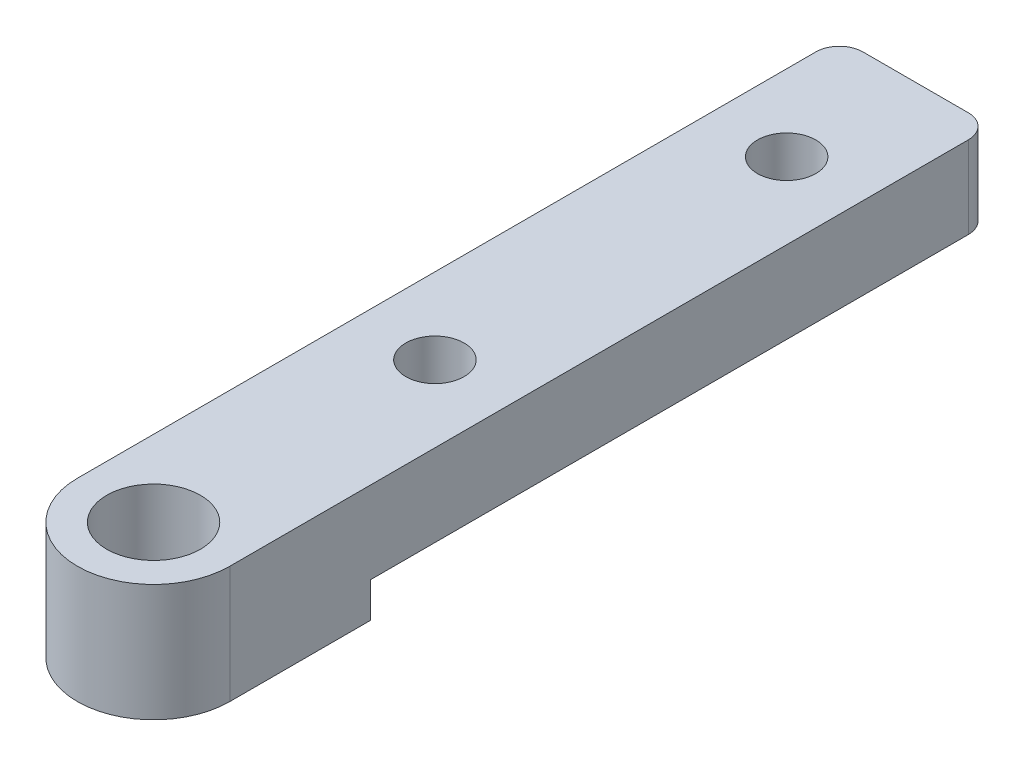
ISO-10303-21;
HEADER;
FILE_DESCRIPTION(('STEP AP214'),'2;1');
FILE_NAME('part.step','',(''),(''),'','','');
FILE_SCHEMA(('AUTOMOTIVE_DESIGN { 1 0 10303 214 1 1 1 1 }'));
ENDSEC;
DATA;
#1=APPLICATION_CONTEXT('core data for automotive mechanical design processes');
#2=APPLICATION_PROTOCOL_DEFINITION('international standard','automotive_design',2000,#1);
#3=PRODUCT_CONTEXT('',#1,'mechanical');
#4=PRODUCT('Part','Part','',(#3));
#5=PRODUCT_RELATED_PRODUCT_CATEGORY('part','',(#4));
#6=PRODUCT_DEFINITION_FORMATION('','',#4);
#7=PRODUCT_DEFINITION_CONTEXT('part definition',#1,'design');
#8=PRODUCT_DEFINITION('design','',#6,#7);
#9=PRODUCT_DEFINITION_SHAPE('','',#8);
#10=(LENGTH_UNIT() NAMED_UNIT(*) SI_UNIT(.MILLI.,.METRE.));
#11=(NAMED_UNIT(*) PLANE_ANGLE_UNIT() SI_UNIT($,.RADIAN.));
#12=(NAMED_UNIT(*) SI_UNIT($,.STERADIAN.) SOLID_ANGLE_UNIT());
#13=UNCERTAINTY_MEASURE_WITH_UNIT(LENGTH_MEASURE(1.E-05),#10,'distance_accuracy_value','');
#14=(GEOMETRIC_REPRESENTATION_CONTEXT(3) GLOBAL_UNCERTAINTY_ASSIGNED_CONTEXT((#13)) GLOBAL_UNIT_ASSIGNED_CONTEXT((#10,
#11,#12)) REPRESENTATION_CONTEXT('',''));
#15=CARTESIAN_POINT('',(0.,0.,0.));
#16=DIRECTION('',(0.,0.,1.));
#17=DIRECTION('',(1.,0.,0.));
#18=AXIS2_PLACEMENT_3D('',#15,#16,#17);
#19=CARTESIAN_POINT('',(-6.5,3.,-12.));
#20=DIRECTION('',(0.,1.,0.));
#21=DIRECTION('',(0.,0.,1.));
#22=AXIS2_PLACEMENT_3D('',#19,#20,#21);
#23=PLANE('',#22);
#24=CARTESIAN_POINT('',(0.,3.,-54.));
#25=DIRECTION('',(0.,-1.,0.));
#26=DIRECTION('',(0.,0.,-1.));
#27=AXIS2_PLACEMENT_3D('',#24,#25,#26);
#28=CIRCLE('',#27,2.48919999999999);
#29=CARTESIAN_POINT('',(0.,3.,-56.4892));
#30=VERTEX_POINT('',#29);
#31=EDGE_CURVE('E309',#30,#30,#28,.T.);
#32=ORIENTED_EDGE('',*,*,#31,.F.);
#33=EDGE_LOOP('',(#32));
#34=FACE_BOUND('',#33,.T.);
#35=DIRECTION('',(0.,0.,-1.));
#36=VECTOR('',#35,1.);
#37=CARTESIAN_POINT('',(-6.5,3.,-65.));
#38=LINE('',#37,#36);
#39=CARTESIAN_POINT('',(-6.5,3.,-12.));
#40=VERTEX_POINT('',#39);
#41=CARTESIAN_POINT('',(-6.5,3.,-63.));
#42=VERTEX_POINT('',#41);
#43=EDGE_CURVE('E177',#40,#42,#38,.T.);
#44=ORIENTED_EDGE('',*,*,#43,.T.);
#45=CARTESIAN_POINT('',(-4.5,3.,-63.));
#46=DIRECTION('',(0.,1.,0.));
#47=DIRECTION('',(0.,0.,1.));
#48=AXIS2_PLACEMENT_3D('',#45,#46,#47);
#49=CIRCLE('',#48,2.);
#50=CARTESIAN_POINT('',(-4.5,3.,-65.));
#51=VERTEX_POINT('',#50);
#52=EDGE_CURVE('E158',#42,#51,#49,.F.);
#53=ORIENTED_EDGE('',*,*,#52,.T.);
#54=DIRECTION('',(1.,0.,0.));
#55=VECTOR('',#54,1.);
#56=CARTESIAN_POINT('',(-6.5,3.,-65.));
#57=LINE('',#56,#55);
#58=CARTESIAN_POINT('',(4.49999999999999,3.,-65.));
#59=VERTEX_POINT('',#58);
#60=EDGE_CURVE('E105',#51,#59,#57,.T.);
#61=ORIENTED_EDGE('',*,*,#60,.T.);
#62=CARTESIAN_POINT('',(4.49999999999999,3.,-63.));
#63=DIRECTION('',(0.,1.,0.));
#64=DIRECTION('',(0.,0.,1.));
#65=AXIS2_PLACEMENT_3D('',#62,#63,#64);
#66=CIRCLE('',#65,2.);
#67=CARTESIAN_POINT('',(6.5,3.,-63.));
#68=VERTEX_POINT('',#67);
#69=EDGE_CURVE('E103',#59,#68,#66,.F.);
#70=ORIENTED_EDGE('',*,*,#69,.T.);
#71=DIRECTION('',(0.,0.,1.));
#72=VECTOR('',#71,1.);
#73=CARTESIAN_POINT('',(6.5,3.,-65.));
#74=LINE('',#73,#72);
#75=CARTESIAN_POINT('',(6.5,3.,-12.));
#76=VERTEX_POINT('',#75);
#77=EDGE_CURVE('E96',#68,#76,#74,.T.);
#78=ORIENTED_EDGE('',*,*,#77,.T.);
#79=DIRECTION('',(-1.,0.,0.));
#80=VECTOR('',#79,1.);
#81=CARTESIAN_POINT('',(-6.5,3.,-12.));
#82=LINE('',#81,#80);
#83=EDGE_CURVE('E100',#76,#40,#82,.T.);
#84=ORIENTED_EDGE('',*,*,#83,.T.);
#85=EDGE_LOOP('',(#44,#53,#61,#70,#78,#84));
#86=FACE_BOUND('',#85,.T.);
#87=CARTESIAN_POINT('',(0.,3.,-24.));
#88=DIRECTION('',(0.,-1.,0.));
#89=DIRECTION('',(0.,0.,-1.));
#90=AXIS2_PLACEMENT_3D('',#87,#88,#89);
#91=CIRCLE('',#90,2.48919999999999);
#92=CARTESIAN_POINT('',(0.,3.,-26.4892));
#93=VERTEX_POINT('',#92);
#94=EDGE_CURVE('E154',#93,#93,#91,.T.);
#95=ORIENTED_EDGE('',*,*,#94,.F.);
#96=EDGE_LOOP('',(#95));
#97=FACE_BOUND('',#96,.T.);
#98=ADVANCED_FACE('F32',(#34,#86,#97),#23,.F.);
#99=CARTESIAN_POINT('',(0.,10.,0.));
#100=DIRECTION('',(0.,1.,0.));
#101=DIRECTION('',(0.,0.,1.));
#102=AXIS2_PLACEMENT_3D('',#99,#100,#101);
#103=PLANE('',#102);
#104=CARTESIAN_POINT('',(0.,10.,-54.));
#105=DIRECTION('',(0.,1.,0.));
#106=DIRECTION('',(0.,0.,1.));
#107=AXIS2_PLACEMENT_3D('',#104,#105,#106);
#108=CIRCLE('',#107,2.48919999999999);
#109=CARTESIAN_POINT('',(0.,10.,-51.5108));
#110=VERTEX_POINT('',#109);
#111=EDGE_CURVE('E307',#110,#110,#108,.T.);
#112=ORIENTED_EDGE('',*,*,#111,.F.);
#113=EDGE_LOOP('',(#112));
#114=FACE_BOUND('',#113,.T.);
#115=CARTESIAN_POINT('',(0.,10.,-24.));
#116=DIRECTION('',(0.,1.,0.));
#117=DIRECTION('',(0.,0.,1.));
#118=AXIS2_PLACEMENT_3D('',#115,#116,#117);
#119=CIRCLE('',#118,2.48919999999999);
#120=CARTESIAN_POINT('',(0.,10.,-21.5108));
#121=VERTEX_POINT('',#120);
#122=EDGE_CURVE('E150',#121,#121,#119,.T.);
#123=ORIENTED_EDGE('',*,*,#122,.F.);
#124=EDGE_LOOP('',(#123));
#125=FACE_BOUND('',#124,.T.);
#126=DIRECTION('',(-1.,0.,0.));
#127=VECTOR('',#126,1.);
#128=CARTESIAN_POINT('',(-6.5,10.,-65.));
#129=LINE('',#128,#127);
#130=CARTESIAN_POINT('',(4.49999999999999,10.,-65.));
#131=VERTEX_POINT('',#130);
#132=CARTESIAN_POINT('',(-4.5,10.,-65.));
#133=VERTEX_POINT('',#132);
#134=EDGE_CURVE('E136',#131,#133,#129,.T.);
#135=ORIENTED_EDGE('',*,*,#134,.T.);
#136=CARTESIAN_POINT('',(-4.5,10.,-63.));
#137=DIRECTION('',(0.,1.,0.));
#138=DIRECTION('',(0.,0.,1.));
#139=AXIS2_PLACEMENT_3D('',#136,#137,#138);
#140=CIRCLE('',#139,2.);
#141=CARTESIAN_POINT('',(-6.5,10.,-63.));
#142=VERTEX_POINT('',#141);
#143=EDGE_CURVE('E40',#133,#142,#140,.T.);
#144=ORIENTED_EDGE('',*,*,#143,.T.);
#145=DIRECTION('',(0.,0.,1.));
#146=VECTOR('',#145,1.);
#147=CARTESIAN_POINT('',(-6.5,10.,0.));
#148=LINE('',#147,#146);
#149=CARTESIAN_POINT('',(-6.5,10.,0.));
#150=VERTEX_POINT('',#149);
#151=EDGE_CURVE('E138',#142,#150,#148,.T.);
#152=ORIENTED_EDGE('',*,*,#151,.T.);
#153=CARTESIAN_POINT('',(0.,10.,0.));
#154=DIRECTION('',(0.,1.,0.));
#155=DIRECTION('',(0.,0.,1.));
#156=AXIS2_PLACEMENT_3D('',#153,#154,#155);
#157=CIRCLE('',#156,6.5);
#158=CARTESIAN_POINT('',(6.49999999999999,10.,0.));
#159=VERTEX_POINT('',#158);
#160=EDGE_CURVE('E130',#150,#159,#157,.T.);
#161=ORIENTED_EDGE('',*,*,#160,.T.);
#162=DIRECTION('',(0.,0.,-1.));
#163=VECTOR('',#162,1.);
#164=CARTESIAN_POINT('',(6.49999999999999,10.,-65.));
#165=LINE('',#164,#163);
#166=CARTESIAN_POINT('',(6.49999999999999,10.,-63.));
#167=VERTEX_POINT('',#166);
#168=EDGE_CURVE('E133',#159,#167,#165,.T.);
#169=ORIENTED_EDGE('',*,*,#168,.T.);
#170=CARTESIAN_POINT('',(4.49999999999999,10.,-63.));
#171=DIRECTION('',(0.,1.,0.));
#172=DIRECTION('',(0.,0.,1.));
#173=AXIS2_PLACEMENT_3D('',#170,#171,#172);
#174=CIRCLE('',#173,2.);
#175=EDGE_CURVE('E164',#167,#131,#174,.T.);
#176=ORIENTED_EDGE('',*,*,#175,.T.);
#177=EDGE_LOOP('',(#135,#144,#152,#161,#169,#176));
#178=FACE_BOUND('',#177,.T.);
#179=CARTESIAN_POINT('',(0.,10.,0.));
#180=DIRECTION('',(0.,1.,0.));
#181=DIRECTION('',(0.,0.,1.));
#182=AXIS2_PLACEMENT_3D('',#179,#180,#181);
#183=CIRCLE('',#182,3.99415);
#184=CARTESIAN_POINT('',(0.,10.,3.99415));
#185=VERTEX_POINT('',#184);
#186=EDGE_CURVE('E124',#185,#185,#183,.T.);
#187=ORIENTED_EDGE('',*,*,#186,.F.);
#188=EDGE_LOOP('',(#187));
#189=FACE_BOUND('',#188,.T.);
#190=ADVANCED_FACE('F168',(#114,#125,#178,#189),#103,.T.);
#191=CARTESIAN_POINT('',(0.,0.,0.));
#192=DIRECTION('',(0.,1.,0.));
#193=DIRECTION('',(0.,0.,1.));
#194=AXIS2_PLACEMENT_3D('',#191,#192,#193);
#195=PLANE('',#194);
#196=DIRECTION('',(0.,0.,1.));
#197=VECTOR('',#196,1.);
#198=CARTESIAN_POINT('',(-6.5,0.,0.));
#199=LINE('',#198,#197);
#200=CARTESIAN_POINT('',(-6.5,0.,-12.));
#201=VERTEX_POINT('',#200);
#202=CARTESIAN_POINT('',(-6.5,0.,0.));
#203=VERTEX_POINT('',#202);
#204=EDGE_CURVE('E134',#201,#203,#199,.T.);
#205=ORIENTED_EDGE('',*,*,#204,.F.);
#206=DIRECTION('',(-1.,0.,0.));
#207=VECTOR('',#206,1.);
#208=CARTESIAN_POINT('',(-6.5,0.,-12.));
#209=LINE('',#208,#207);
#210=CARTESIAN_POINT('',(6.5,0.,-12.));
#211=VERTEX_POINT('',#210);
#212=EDGE_CURVE('E153',#211,#201,#209,.T.);
#213=ORIENTED_EDGE('',*,*,#212,.F.);
#214=DIRECTION('',(0.,0.,-1.));
#215=VECTOR('',#214,1.);
#216=CARTESIAN_POINT('',(6.49999999999999,0.,-65.));
#217=LINE('',#216,#215);
#218=CARTESIAN_POINT('',(6.49999999999999,0.,0.));
#219=VERTEX_POINT('',#218);
#220=EDGE_CURVE('E118',#219,#211,#217,.T.);
#221=ORIENTED_EDGE('',*,*,#220,.F.);
#222=CARTESIAN_POINT('',(0.,0.,0.));
#223=DIRECTION('',(0.,1.,0.));
#224=DIRECTION('',(0.,0.,1.));
#225=AXIS2_PLACEMENT_3D('',#222,#223,#224);
#226=CIRCLE('',#225,6.5);
#227=EDGE_CURVE('E127',#203,#219,#226,.T.);
#228=ORIENTED_EDGE('',*,*,#227,.F.);
#229=EDGE_LOOP('',(#205,#213,#221,#228));
#230=FACE_BOUND('',#229,.T.);
#231=CARTESIAN_POINT('',(0.,0.,0.));
#232=DIRECTION('',(0.,1.,0.));
#233=DIRECTION('',(0.,0.,1.));
#234=AXIS2_PLACEMENT_3D('',#231,#232,#233);
#235=CIRCLE('',#234,3.99415);
#236=CARTESIAN_POINT('',(0.,0.,3.99415));
#237=VERTEX_POINT('',#236);
#238=EDGE_CURVE('E120',#237,#237,#235,.T.);
#239=ORIENTED_EDGE('',*,*,#238,.T.);
#240=EDGE_LOOP('',(#239));
#241=FACE_BOUND('',#240,.T.);
#242=ADVANCED_FACE('F186',(#230,#241),#195,.F.);
#243=CARTESIAN_POINT('',(0.,10.,0.));
#244=DIRECTION('',(0.,-1.,0.));
#245=DIRECTION('',(0.,0.,-1.));
#246=AXIS2_PLACEMENT_3D('',#243,#244,#245);
#247=CYLINDRICAL_SURFACE('',#246,6.5);
#248=ORIENTED_EDGE('',*,*,#227,.T.);
#249=DIRECTION('',(0.,-1.,0.));
#250=VECTOR('',#249,1.);
#251=CARTESIAN_POINT('',(6.49999999999999,10.,0.));
#252=LINE('',#251,#250);
#253=EDGE_CURVE('E147',#159,#219,#252,.T.);
#254=ORIENTED_EDGE('',*,*,#253,.F.);
#255=ORIENTED_EDGE('',*,*,#160,.F.);
#256=DIRECTION('',(0.,-1.,0.));
#257=VECTOR('',#256,1.);
#258=CARTESIAN_POINT('',(-6.5,10.,0.));
#259=LINE('',#258,#257);
#260=EDGE_CURVE('E140',#150,#203,#259,.T.);
#261=ORIENTED_EDGE('',*,*,#260,.T.);
#262=EDGE_LOOP('',(#248,#254,#255,#261));
#263=FACE_BOUND('',#262,.T.);
#264=ADVANCED_FACE('F190',(#263),#247,.T.);
#265=CARTESIAN_POINT('',(6.49999999999999,10.,-65.));
#266=DIRECTION('',(-1.,0.,0.));
#267=DIRECTION('',(0.,0.,1.));
#268=AXIS2_PLACEMENT_3D('',#265,#266,#267);
#269=PLANE('',#268);
#270=ORIENTED_EDGE('',*,*,#77,.F.);
#271=DIRECTION('',(0.,-1.,0.));
#272=VECTOR('',#271,1.);
#273=CARTESIAN_POINT('',(6.49999999999999,10.,-63.));
#274=LINE('',#273,#272);
#275=EDGE_CURVE('E11',#68,#167,#274,.F.);
#276=ORIENTED_EDGE('',*,*,#275,.T.);
#277=ORIENTED_EDGE('',*,*,#168,.F.);
#278=ORIENTED_EDGE('',*,*,#253,.T.);
#279=ORIENTED_EDGE('',*,*,#220,.T.);
#280=DIRECTION('',(0.,-1.,0.));
#281=VECTOR('',#280,1.);
#282=CARTESIAN_POINT('',(6.5,3.,-12.));
#283=LINE('',#282,#281);
#284=EDGE_CURVE('E109',#76,#211,#283,.T.);
#285=ORIENTED_EDGE('',*,*,#284,.F.);
#286=EDGE_LOOP('',(#270,#276,#277,#278,#279,#285));
#287=FACE_BOUND('',#286,.T.);
#288=ADVANCED_FACE('F116',(#287),#269,.F.);
#289=CARTESIAN_POINT('',(-6.5,10.,-65.));
#290=DIRECTION('',(0.,0.,1.));
#291=DIRECTION('',(1.,0.,0.));
#292=AXIS2_PLACEMENT_3D('',#289,#290,#291);
#293=PLANE('',#292);
#294=ORIENTED_EDGE('',*,*,#60,.F.);
#295=DIRECTION('',(0.,-1.,0.));
#296=VECTOR('',#295,1.);
#297=CARTESIAN_POINT('',(-4.5,10.,-65.));
#298=LINE('',#297,#296);
#299=EDGE_CURVE('E53',#51,#133,#298,.F.);
#300=ORIENTED_EDGE('',*,*,#299,.T.);
#301=ORIENTED_EDGE('',*,*,#134,.F.);
#302=DIRECTION('',(0.,-1.,0.));
#303=VECTOR('',#302,1.);
#304=CARTESIAN_POINT('',(4.49999999999999,10.,-65.));
#305=LINE('',#304,#303);
#306=EDGE_CURVE('E160',#131,#59,#305,.T.);
#307=ORIENTED_EDGE('',*,*,#306,.T.);
#308=EDGE_LOOP('',(#294,#300,#301,#307));
#309=FACE_BOUND('',#308,.T.);
#310=ADVANCED_FACE('F178',(#309),#293,.F.);
#311=CARTESIAN_POINT('',(-6.5,10.,0.));
#312=DIRECTION('',(1.,0.,0.));
#313=DIRECTION('',(0.,0.,-1.));
#314=AXIS2_PLACEMENT_3D('',#311,#312,#313);
#315=PLANE('',#314);
#316=ORIENTED_EDGE('',*,*,#151,.F.);
#317=DIRECTION('',(0.,-1.,0.));
#318=VECTOR('',#317,1.);
#319=CARTESIAN_POINT('',(-6.5,10.,-63.));
#320=LINE('',#319,#318);
#321=EDGE_CURVE('E149',#142,#42,#320,.T.);
#322=ORIENTED_EDGE('',*,*,#321,.T.);
#323=ORIENTED_EDGE('',*,*,#43,.F.);
#324=DIRECTION('',(0.,-1.,0.));
#325=VECTOR('',#324,1.);
#326=CARTESIAN_POINT('',(-6.5,3.,-12.));
#327=LINE('',#326,#325);
#328=EDGE_CURVE('E112',#40,#201,#327,.T.);
#329=ORIENTED_EDGE('',*,*,#328,.T.);
#330=ORIENTED_EDGE('',*,*,#204,.T.);
#331=ORIENTED_EDGE('',*,*,#260,.F.);
#332=EDGE_LOOP('',(#316,#322,#323,#329,#330,#331));
#333=FACE_BOUND('',#332,.T.);
#334=ADVANCED_FACE('F174',(#333),#315,.F.);
#335=CARTESIAN_POINT('',(0.,10.,0.));
#336=DIRECTION('',(0.,-1.,0.));
#337=DIRECTION('',(0.,0.,-1.));
#338=AXIS2_PLACEMENT_3D('',#335,#336,#337);
#339=CYLINDRICAL_SURFACE('',#338,3.99415);
#340=ORIENTED_EDGE('',*,*,#186,.T.);
#341=EDGE_LOOP('',(#340));
#342=FACE_BOUND('',#341,.T.);
#343=ORIENTED_EDGE('',*,*,#238,.F.);
#344=EDGE_LOOP('',(#343));
#345=FACE_BOUND('',#344,.T.);
#346=ADVANCED_FACE('F213',(#342,#345),#339,.F.);
#347=CARTESIAN_POINT('',(-6.5,3.,-12.));
#348=DIRECTION('',(0.,0.,1.));
#349=DIRECTION('',(1.,0.,0.));
#350=AXIS2_PLACEMENT_3D('',#347,#348,#349);
#351=PLANE('',#350);
#352=ORIENTED_EDGE('',*,*,#212,.T.);
#353=ORIENTED_EDGE('',*,*,#328,.F.);
#354=ORIENTED_EDGE('',*,*,#83,.F.);
#355=ORIENTED_EDGE('',*,*,#284,.T.);
#356=EDGE_LOOP('',(#352,#353,#354,#355));
#357=FACE_BOUND('',#356,.T.);
#358=ADVANCED_FACE('F108',(#357),#351,.F.);
#359=CARTESIAN_POINT('',(0.,3.,-24.));
#360=DIRECTION('',(0.,-1.,0.));
#361=DIRECTION('',(0.,0.,-1.));
#362=AXIS2_PLACEMENT_3D('',#359,#360,#361);
#363=CYLINDRICAL_SURFACE('',#362,2.48919999999999);
#364=ORIENTED_EDGE('',*,*,#122,.T.);
#365=EDGE_LOOP('',(#364));
#366=FACE_BOUND('',#365,.T.);
#367=ORIENTED_EDGE('',*,*,#94,.T.);
#368=EDGE_LOOP('',(#367));
#369=FACE_BOUND('',#368,.T.);
#370=ADVANCED_FACE('F209',(#366,#369),#363,.F.);
#371=CARTESIAN_POINT('',(0.,3.,-54.));
#372=DIRECTION('',(0.,-1.,0.));
#373=DIRECTION('',(0.,0.,-1.));
#374=AXIS2_PLACEMENT_3D('',#371,#372,#373);
#375=CYLINDRICAL_SURFACE('',#374,2.48919999999999);
#376=ORIENTED_EDGE('',*,*,#111,.T.);
#377=EDGE_LOOP('',(#376));
#378=FACE_BOUND('',#377,.T.);
#379=ORIENTED_EDGE('',*,*,#31,.T.);
#380=EDGE_LOOP('',(#379));
#381=FACE_BOUND('',#380,.T.);
#382=ADVANCED_FACE('F197',(#378,#381),#375,.F.);
#383=CARTESIAN_POINT('',(-4.5,10.,-63.));
#384=DIRECTION('',(0.,-1.,0.));
#385=DIRECTION('',(0.,0.,-1.));
#386=AXIS2_PLACEMENT_3D('',#383,#384,#385);
#387=CYLINDRICAL_SURFACE('',#386,2.);
#388=ORIENTED_EDGE('',*,*,#143,.F.);
#389=ORIENTED_EDGE('',*,*,#299,.F.);
#390=ORIENTED_EDGE('',*,*,#52,.F.);
#391=ORIENTED_EDGE('',*,*,#321,.F.);
#392=EDGE_LOOP('',(#388,#389,#390,#391));
#393=FACE_BOUND('',#392,.T.);
#394=ADVANCED_FACE('F176',(#393),#387,.T.);
#395=CARTESIAN_POINT('',(4.49999999999999,10.,-63.));
#396=DIRECTION('',(0.,-1.,0.));
#397=DIRECTION('',(0.,0.,-1.));
#398=AXIS2_PLACEMENT_3D('',#395,#396,#397);
#399=CYLINDRICAL_SURFACE('',#398,2.);
#400=ORIENTED_EDGE('',*,*,#175,.F.);
#401=ORIENTED_EDGE('',*,*,#275,.F.);
#402=ORIENTED_EDGE('',*,*,#69,.F.);
#403=ORIENTED_EDGE('',*,*,#306,.F.);
#404=EDGE_LOOP('',(#400,#401,#402,#403));
#405=FACE_BOUND('',#404,.T.);
#406=ADVANCED_FACE('F34',(#405),#399,.T.);
#407=CLOSED_SHELL('',(#98,#190,#242,#264,#288,#310,#334,#346,#358,#370,#382,#394,#406));
#408=MANIFOLD_SOLID_BREP('B2',#407);
#409=ADVANCED_BREP_SHAPE_REPRESENTATION('',(#18,#408),#14);
#410=SHAPE_DEFINITION_REPRESENTATION(#9,#409);
ENDSEC;
END-ISO-10303-21;
